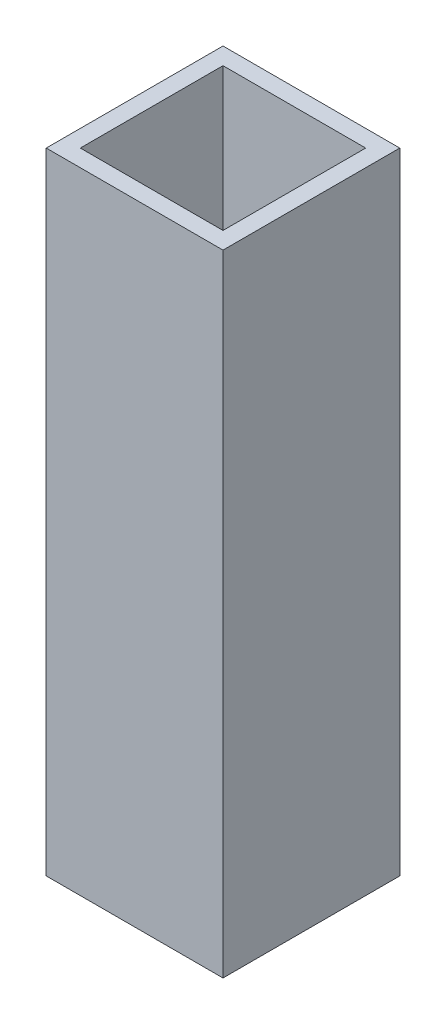
ISO-10303-21;
HEADER;
FILE_DESCRIPTION(('STEP AP214'),'2;1');
FILE_NAME('part.step','',(''),(''),'','','');
FILE_SCHEMA(('AUTOMOTIVE_DESIGN { 1 0 10303 214 1 1 1 1 }'));
ENDSEC;
DATA;
#1=APPLICATION_CONTEXT('core data for automotive mechanical design processes');
#2=APPLICATION_PROTOCOL_DEFINITION('international standard','automotive_design',2000,#1);
#3=PRODUCT_CONTEXT('',#1,'mechanical');
#4=PRODUCT('Part','Part','',(#3));
#5=PRODUCT_RELATED_PRODUCT_CATEGORY('part','',(#4));
#6=PRODUCT_DEFINITION_FORMATION('','',#4);
#7=PRODUCT_DEFINITION_CONTEXT('part definition',#1,'design');
#8=PRODUCT_DEFINITION('design','',#6,#7);
#9=PRODUCT_DEFINITION_SHAPE('','',#8);
#10=(LENGTH_UNIT() NAMED_UNIT(*) SI_UNIT(.MILLI.,.METRE.));
#11=(NAMED_UNIT(*) PLANE_ANGLE_UNIT() SI_UNIT($,.RADIAN.));
#12=(NAMED_UNIT(*) SI_UNIT($,.STERADIAN.) SOLID_ANGLE_UNIT());
#13=UNCERTAINTY_MEASURE_WITH_UNIT(LENGTH_MEASURE(1.E-05),#10,'distance_accuracy_value','');
#14=(GEOMETRIC_REPRESENTATION_CONTEXT(3) GLOBAL_UNCERTAINTY_ASSIGNED_CONTEXT((#13)) GLOBAL_UNIT_ASSIGNED_CONTEXT((#10,
#11,#12)) REPRESENTATION_CONTEXT('',''));
#15=CARTESIAN_POINT('',(0.,0.,0.));
#16=DIRECTION('',(0.,0.,1.));
#17=DIRECTION('',(1.,0.,0.));
#18=AXIS2_PLACEMENT_3D('',#15,#16,#17);
#19=CARTESIAN_POINT('',(0.,44.4,0.));
#20=DIRECTION('',(0.,-1.,0.));
#21=DIRECTION('',(0.,0.,-1.));
#22=AXIS2_PLACEMENT_3D('',#19,#20,#21);
#23=PLANE('',#22);
#24=DIRECTION('',(0.,0.,-1.));
#25=VECTOR('',#24,1.);
#26=CARTESIAN_POINT('',(6.225,44.4,6.225));
#27=LINE('',#26,#25);
#28=CARTESIAN_POINT('',(6.225,44.4,6.225));
#29=VERTEX_POINT('',#28);
#30=CARTESIAN_POINT('',(6.225,44.4,-6.225));
#31=VERTEX_POINT('',#30);
#32=EDGE_CURVE('E147',#29,#31,#27,.T.);
#33=ORIENTED_EDGE('',*,*,#32,.T.);
#34=DIRECTION('',(-1.,0.,0.));
#35=VECTOR('',#34,1.);
#36=CARTESIAN_POINT('',(-6.225,44.4,-6.225));
#37=LINE('',#36,#35);
#38=CARTESIAN_POINT('',(-6.225,44.4,-6.225));
#39=VERTEX_POINT('',#38);
#40=EDGE_CURVE('E91',#31,#39,#37,.T.);
#41=ORIENTED_EDGE('',*,*,#40,.T.);
#42=DIRECTION('',(0.,0.,1.));
#43=VECTOR('',#42,1.);
#44=CARTESIAN_POINT('',(-6.225,44.4,6.225));
#45=LINE('',#44,#43);
#46=CARTESIAN_POINT('',(-6.225,44.4,6.225));
#47=VERTEX_POINT('',#46);
#48=EDGE_CURVE('E150',#39,#47,#45,.T.);
#49=ORIENTED_EDGE('',*,*,#48,.T.);
#50=DIRECTION('',(1.,0.,0.));
#51=VECTOR('',#50,1.);
#52=CARTESIAN_POINT('',(-6.225,44.4,6.225));
#53=LINE('',#52,#51);
#54=EDGE_CURVE('E63',#47,#29,#53,.T.);
#55=ORIENTED_EDGE('',*,*,#54,.T.);
#56=EDGE_LOOP('',(#33,#41,#49,#55));
#57=FACE_BOUND('',#56,.T.);
#58=DIRECTION('',(0.,0.,-1.));
#59=VECTOR('',#58,1.);
#60=CARTESIAN_POINT('',(5.025,44.4,0.));
#61=LINE('',#60,#59);
#62=CARTESIAN_POINT('',(5.025,44.4,5.025));
#63=VERTEX_POINT('',#62);
#64=CARTESIAN_POINT('',(5.025,44.4,-5.025));
#65=VERTEX_POINT('',#64);
#66=EDGE_CURVE('E136',#63,#65,#61,.T.);
#67=ORIENTED_EDGE('',*,*,#66,.F.);
#68=DIRECTION('',(1.,0.,0.));
#69=VECTOR('',#68,1.);
#70=CARTESIAN_POINT('',(0.,44.4,5.025));
#71=LINE('',#70,#69);
#72=CARTESIAN_POINT('',(-5.025,44.4,5.025));
#73=VERTEX_POINT('',#72);
#74=EDGE_CURVE('E145',#73,#63,#71,.T.);
#75=ORIENTED_EDGE('',*,*,#74,.F.);
#76=DIRECTION('',(0.,0.,1.));
#77=VECTOR('',#76,1.);
#78=CARTESIAN_POINT('',(-5.025,44.4,0.));
#79=LINE('',#78,#77);
#80=CARTESIAN_POINT('',(-5.025,44.4,-5.025));
#81=VERTEX_POINT('',#80);
#82=EDGE_CURVE('E143',#81,#73,#79,.T.);
#83=ORIENTED_EDGE('',*,*,#82,.F.);
#84=DIRECTION('',(-1.,0.,0.));
#85=VECTOR('',#84,1.);
#86=CARTESIAN_POINT('',(0.,44.4,-5.025));
#87=LINE('',#86,#85);
#88=EDGE_CURVE('E128',#65,#81,#87,.T.);
#89=ORIENTED_EDGE('',*,*,#88,.F.);
#90=EDGE_LOOP('',(#67,#75,#83,#89));
#91=FACE_BOUND('',#90,.T.);
#92=ADVANCED_FACE('F39',(#57,#91),#23,.F.);
#93=CARTESIAN_POINT('',(6.225,44.4,6.225));
#94=DIRECTION('',(-1.,0.,0.));
#95=DIRECTION('',(0.,0.,1.));
#96=AXIS2_PLACEMENT_3D('',#93,#94,#95);
#97=PLANE('',#96);
#98=DIRECTION('',(0.,0.,-1.));
#99=VECTOR('',#98,1.);
#100=CARTESIAN_POINT('',(6.225,0.,6.225));
#101=LINE('',#100,#99);
#102=CARTESIAN_POINT('',(6.225,0.,6.225));
#103=VERTEX_POINT('',#102);
#104=CARTESIAN_POINT('',(6.225,0.,-6.225));
#105=VERTEX_POINT('',#104);
#106=EDGE_CURVE('E154',#103,#105,#101,.T.);
#107=ORIENTED_EDGE('',*,*,#106,.T.);
#108=DIRECTION('',(0.,-1.,0.));
#109=VECTOR('',#108,1.);
#110=CARTESIAN_POINT('',(6.225,44.4,-6.225));
#111=LINE('',#110,#109);
#112=EDGE_CURVE('E11',#31,#105,#111,.T.);
#113=ORIENTED_EDGE('',*,*,#112,.F.);
#114=ORIENTED_EDGE('',*,*,#32,.F.);
#115=DIRECTION('',(0.,-1.,0.));
#116=VECTOR('',#115,1.);
#117=CARTESIAN_POINT('',(6.225,44.4,6.225));
#118=LINE('',#117,#116);
#119=EDGE_CURVE('E153',#29,#103,#118,.T.);
#120=ORIENTED_EDGE('',*,*,#119,.T.);
#121=EDGE_LOOP('',(#107,#113,#114,#120));
#122=FACE_BOUND('',#121,.T.);
#123=ADVANCED_FACE('F41',(#122),#97,.F.);
#124=CARTESIAN_POINT('',(-6.225,44.4,-6.225));
#125=DIRECTION('',(0.,0.,1.));
#126=DIRECTION('',(1.,0.,0.));
#127=AXIS2_PLACEMENT_3D('',#124,#125,#126);
#128=PLANE('',#127);
#129=DIRECTION('',(-1.,0.,0.));
#130=VECTOR('',#129,1.);
#131=CARTESIAN_POINT('',(-6.225,0.,-6.225));
#132=LINE('',#131,#130);
#133=CARTESIAN_POINT('',(-6.225,0.,-6.225));
#134=VERTEX_POINT('',#133);
#135=EDGE_CURVE('E157',#105,#134,#132,.T.);
#136=ORIENTED_EDGE('',*,*,#135,.T.);
#137=DIRECTION('',(0.,-1.,0.));
#138=VECTOR('',#137,1.);
#139=CARTESIAN_POINT('',(-6.225,44.4,-6.225));
#140=LINE('',#139,#138);
#141=EDGE_CURVE('E47',#39,#134,#140,.T.);
#142=ORIENTED_EDGE('',*,*,#141,.F.);
#143=ORIENTED_EDGE('',*,*,#40,.F.);
#144=ORIENTED_EDGE('',*,*,#112,.T.);
#145=EDGE_LOOP('',(#136,#142,#143,#144));
#146=FACE_BOUND('',#145,.T.);
#147=ADVANCED_FACE('F185',(#146),#128,.F.);
#148=CARTESIAN_POINT('',(-6.225,44.4,6.225));
#149=DIRECTION('',(1.,0.,0.));
#150=DIRECTION('',(0.,0.,-1.));
#151=AXIS2_PLACEMENT_3D('',#148,#149,#150);
#152=PLANE('',#151);
#153=DIRECTION('',(0.,0.,1.));
#154=VECTOR('',#153,1.);
#155=CARTESIAN_POINT('',(-6.225,0.,6.225));
#156=LINE('',#155,#154);
#157=CARTESIAN_POINT('',(-6.225,0.,6.225));
#158=VERTEX_POINT('',#157);
#159=EDGE_CURVE('E159',#134,#158,#156,.T.);
#160=ORIENTED_EDGE('',*,*,#159,.T.);
#161=DIRECTION('',(0.,-1.,0.));
#162=VECTOR('',#161,1.);
#163=CARTESIAN_POINT('',(-6.225,44.4,6.225));
#164=LINE('',#163,#162);
#165=EDGE_CURVE('E163',#47,#158,#164,.T.);
#166=ORIENTED_EDGE('',*,*,#165,.F.);
#167=ORIENTED_EDGE('',*,*,#48,.F.);
#168=ORIENTED_EDGE('',*,*,#141,.T.);
#169=EDGE_LOOP('',(#160,#166,#167,#168));
#170=FACE_BOUND('',#169,.T.);
#171=ADVANCED_FACE('F168',(#170),#152,.F.);
#172=CARTESIAN_POINT('',(-6.225,44.4,6.225));
#173=DIRECTION('',(0.,0.,-1.));
#174=DIRECTION('',(-1.,0.,0.));
#175=AXIS2_PLACEMENT_3D('',#172,#173,#174);
#176=PLANE('',#175);
#177=DIRECTION('',(1.,0.,0.));
#178=VECTOR('',#177,1.);
#179=CARTESIAN_POINT('',(-6.225,0.,6.225));
#180=LINE('',#179,#178);
#181=EDGE_CURVE('E84',#158,#103,#180,.T.);
#182=ORIENTED_EDGE('',*,*,#181,.T.);
#183=ORIENTED_EDGE('',*,*,#119,.F.);
#184=ORIENTED_EDGE('',*,*,#54,.F.);
#185=ORIENTED_EDGE('',*,*,#165,.T.);
#186=EDGE_LOOP('',(#182,#183,#184,#185));
#187=FACE_BOUND('',#186,.T.);
#188=ADVANCED_FACE('F176',(#187),#176,.F.);
#189=CARTESIAN_POINT('',(0.,0.,0.));
#190=DIRECTION('',(0.,-1.,0.));
#191=DIRECTION('',(0.,0.,-1.));
#192=AXIS2_PLACEMENT_3D('',#189,#190,#191);
#193=PLANE('',#192);
#194=ORIENTED_EDGE('',*,*,#106,.F.);
#195=ORIENTED_EDGE('',*,*,#181,.F.);
#196=ORIENTED_EDGE('',*,*,#159,.F.);
#197=ORIENTED_EDGE('',*,*,#135,.F.);
#198=EDGE_LOOP('',(#194,#195,#196,#197));
#199=FACE_BOUND('',#198,.T.);
#200=ADVANCED_FACE('F172',(#199),#193,.T.);
#201=CARTESIAN_POINT('',(5.025,44.4,6.225));
#202=DIRECTION('',(-1.,0.,0.));
#203=DIRECTION('',(0.,0.,1.));
#204=AXIS2_PLACEMENT_3D('',#201,#202,#203);
#205=PLANE('',#204);
#206=DIRECTION('',(0.,0.,-1.));
#207=VECTOR('',#206,1.);
#208=CARTESIAN_POINT('',(5.025,1.2,0.));
#209=LINE('',#208,#207);
#210=CARTESIAN_POINT('',(5.025,1.2,5.025));
#211=VERTEX_POINT('',#210);
#212=CARTESIAN_POINT('',(5.025,1.2,-5.025));
#213=VERTEX_POINT('',#212);
#214=EDGE_CURVE('E119',#211,#213,#209,.T.);
#215=ORIENTED_EDGE('',*,*,#214,.F.);
#216=DIRECTION('',(0.,-1.,0.));
#217=VECTOR('',#216,1.);
#218=CARTESIAN_POINT('',(5.025,44.4,5.025));
#219=LINE('',#218,#217);
#220=EDGE_CURVE('E139',#63,#211,#219,.T.);
#221=ORIENTED_EDGE('',*,*,#220,.F.);
#222=ORIENTED_EDGE('',*,*,#66,.T.);
#223=DIRECTION('',(0.,-1.,0.));
#224=VECTOR('',#223,1.);
#225=CARTESIAN_POINT('',(5.025,44.4,-5.025));
#226=LINE('',#225,#224);
#227=EDGE_CURVE('E131',#65,#213,#226,.T.);
#228=ORIENTED_EDGE('',*,*,#227,.T.);
#229=EDGE_LOOP('',(#215,#221,#222,#228));
#230=FACE_BOUND('',#229,.T.);
#231=ADVANCED_FACE('F183',(#230),#205,.T.);
#232=CARTESIAN_POINT('',(-6.225,44.4,-5.025));
#233=DIRECTION('',(0.,0.,1.));
#234=DIRECTION('',(1.,0.,0.));
#235=AXIS2_PLACEMENT_3D('',#232,#233,#234);
#236=PLANE('',#235);
#237=DIRECTION('',(-1.,0.,0.));
#238=VECTOR('',#237,1.);
#239=CARTESIAN_POINT('',(0.,1.2,-5.025));
#240=LINE('',#239,#238);
#241=CARTESIAN_POINT('',(-5.025,1.2,-5.025));
#242=VERTEX_POINT('',#241);
#243=EDGE_CURVE('E113',#213,#242,#240,.T.);
#244=ORIENTED_EDGE('',*,*,#243,.F.);
#245=ORIENTED_EDGE('',*,*,#227,.F.);
#246=ORIENTED_EDGE('',*,*,#88,.T.);
#247=DIRECTION('',(0.,-1.,0.));
#248=VECTOR('',#247,1.);
#249=CARTESIAN_POINT('',(-5.025,44.4,-5.025));
#250=LINE('',#249,#248);
#251=EDGE_CURVE('E125',#81,#242,#250,.T.);
#252=ORIENTED_EDGE('',*,*,#251,.T.);
#253=EDGE_LOOP('',(#244,#245,#246,#252));
#254=FACE_BOUND('',#253,.T.);
#255=ADVANCED_FACE('F126',(#254),#236,.T.);
#256=CARTESIAN_POINT('',(-5.025,44.4,6.225));
#257=DIRECTION('',(1.,0.,0.));
#258=DIRECTION('',(0.,0.,-1.));
#259=AXIS2_PLACEMENT_3D('',#256,#257,#258);
#260=PLANE('',#259);
#261=DIRECTION('',(0.,0.,1.));
#262=VECTOR('',#261,1.);
#263=CARTESIAN_POINT('',(-5.025,1.2,0.));
#264=LINE('',#263,#262);
#265=CARTESIAN_POINT('',(-5.025,1.2,5.025));
#266=VERTEX_POINT('',#265);
#267=EDGE_CURVE('E117',#242,#266,#264,.T.);
#268=ORIENTED_EDGE('',*,*,#267,.F.);
#269=ORIENTED_EDGE('',*,*,#251,.F.);
#270=ORIENTED_EDGE('',*,*,#82,.T.);
#271=DIRECTION('',(0.,-1.,0.));
#272=VECTOR('',#271,1.);
#273=CARTESIAN_POINT('',(-5.025,44.4,5.025));
#274=LINE('',#273,#272);
#275=EDGE_CURVE('E54',#73,#266,#274,.T.);
#276=ORIENTED_EDGE('',*,*,#275,.T.);
#277=EDGE_LOOP('',(#268,#269,#270,#276));
#278=FACE_BOUND('',#277,.T.);
#279=ADVANCED_FACE('F133',(#278),#260,.T.);
#280=CARTESIAN_POINT('',(-6.225,44.4,5.025));
#281=DIRECTION('',(0.,0.,-1.));
#282=DIRECTION('',(-1.,0.,0.));
#283=AXIS2_PLACEMENT_3D('',#280,#281,#282);
#284=PLANE('',#283);
#285=DIRECTION('',(1.,0.,0.));
#286=VECTOR('',#285,1.);
#287=CARTESIAN_POINT('',(0.,1.2,5.025));
#288=LINE('',#287,#286);
#289=EDGE_CURVE('E134',#266,#211,#288,.T.);
#290=ORIENTED_EDGE('',*,*,#289,.F.);
#291=ORIENTED_EDGE('',*,*,#275,.F.);
#292=ORIENTED_EDGE('',*,*,#74,.T.);
#293=ORIENTED_EDGE('',*,*,#220,.T.);
#294=EDGE_LOOP('',(#290,#291,#292,#293));
#295=FACE_BOUND('',#294,.T.);
#296=ADVANCED_FACE('F197',(#295),#284,.T.);
#297=CARTESIAN_POINT('',(0.,1.2,0.));
#298=DIRECTION('',(0.,-1.,0.));
#299=DIRECTION('',(0.,0.,-1.));
#300=AXIS2_PLACEMENT_3D('',#297,#298,#299);
#301=PLANE('',#300);
#302=ORIENTED_EDGE('',*,*,#214,.T.);
#303=ORIENTED_EDGE('',*,*,#243,.T.);
#304=ORIENTED_EDGE('',*,*,#267,.T.);
#305=ORIENTED_EDGE('',*,*,#289,.T.);
#306=EDGE_LOOP('',(#302,#303,#304,#305));
#307=FACE_BOUND('',#306,.T.);
#308=ADVANCED_FACE('F115',(#307),#301,.F.);
#309=CLOSED_SHELL('',(#92,#123,#147,#171,#188,#200,#231,#255,#279,#296,#308));
#310=MANIFOLD_SOLID_BREP('B2',#309);
#311=ADVANCED_BREP_SHAPE_REPRESENTATION('',(#18,#310),#14);
#312=SHAPE_DEFINITION_REPRESENTATION(#9,#311);
ENDSEC;
END-ISO-10303-21;
